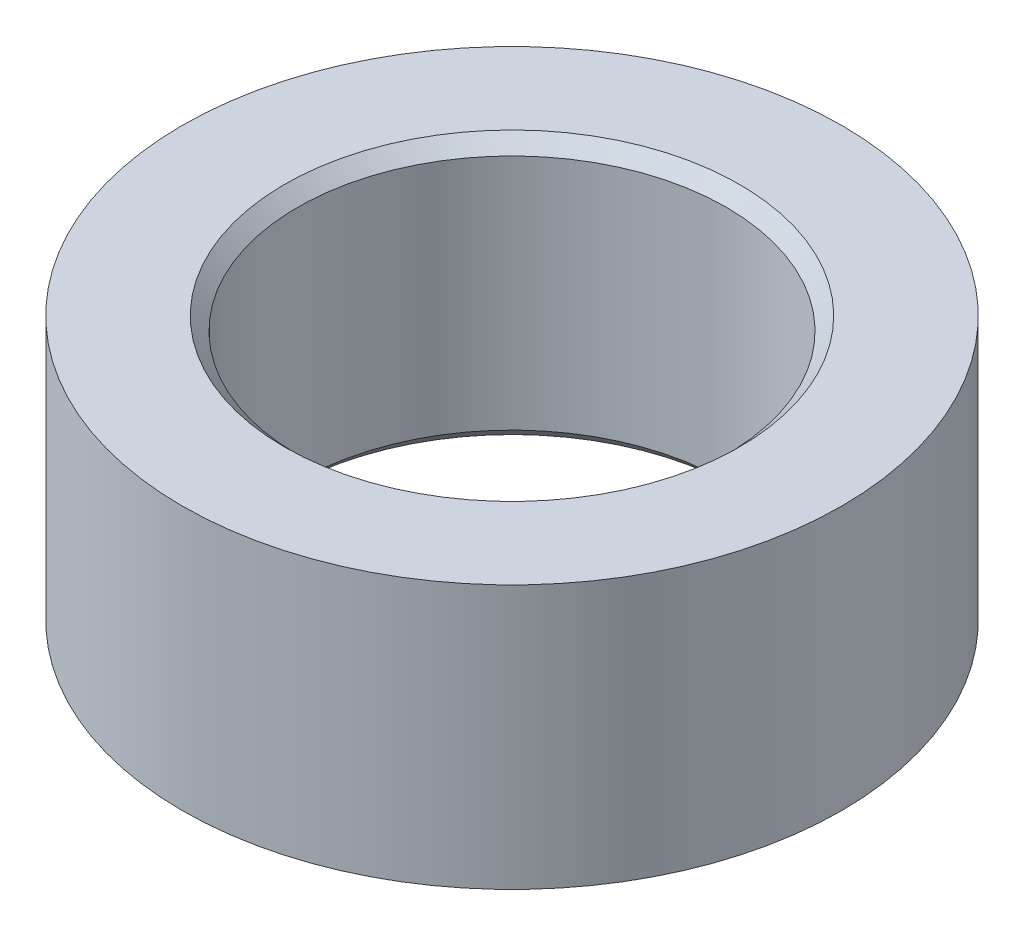
ISO-10303-21;
HEADER;
FILE_DESCRIPTION(('STEP AP214'),'2;1');
FILE_NAME('part.step','',(''),(''),'','','');
FILE_SCHEMA(('AUTOMOTIVE_DESIGN { 1 0 10303 214 1 1 1 1 }'));
ENDSEC;
DATA;
#1=APPLICATION_CONTEXT('core data for automotive mechanical design processes');
#2=APPLICATION_PROTOCOL_DEFINITION('international standard','automotive_design',2000,#1);
#3=PRODUCT_CONTEXT('',#1,'mechanical');
#4=PRODUCT('Part','Part','',(#3));
#5=PRODUCT_RELATED_PRODUCT_CATEGORY('part','',(#4));
#6=PRODUCT_DEFINITION_FORMATION('','',#4);
#7=PRODUCT_DEFINITION_CONTEXT('part definition',#1,'design');
#8=PRODUCT_DEFINITION('design','',#6,#7);
#9=PRODUCT_DEFINITION_SHAPE('','',#8);
#10=(LENGTH_UNIT() NAMED_UNIT(*) SI_UNIT(.MILLI.,.METRE.));
#11=(NAMED_UNIT(*) PLANE_ANGLE_UNIT() SI_UNIT($,.RADIAN.));
#12=(NAMED_UNIT(*) SI_UNIT($,.STERADIAN.) SOLID_ANGLE_UNIT());
#13=UNCERTAINTY_MEASURE_WITH_UNIT(LENGTH_MEASURE(1.E-05),#10,'distance_accuracy_value','');
#14=(GEOMETRIC_REPRESENTATION_CONTEXT(3) GLOBAL_UNCERTAINTY_ASSIGNED_CONTEXT((#13)) GLOBAL_UNIT_ASSIGNED_CONTEXT((#10,
#11,#12)) REPRESENTATION_CONTEXT('',''));
#15=CARTESIAN_POINT('',(0.,0.,0.));
#16=DIRECTION('',(0.,0.,1.));
#17=DIRECTION('',(1.,0.,0.));
#18=AXIS2_PLACEMENT_3D('',#15,#16,#17);
#19=CARTESIAN_POINT('',(0.,5.08,0.));
#20=DIRECTION('',(0.,1.,0.));
#21=DIRECTION('',(0.,0.,1.));
#22=AXIS2_PLACEMENT_3D('',#19,#20,#21);
#23=PLANE('',#22);
#24=CARTESIAN_POINT('',(0.,5.08,0.));
#25=DIRECTION('',(0.,1.,0.));
#26=DIRECTION('',(0.,0.,1.));
#27=AXIS2_PLACEMENT_3D('',#24,#25,#26);
#28=CIRCLE('',#27,4.3815);
#29=CARTESIAN_POINT('',(0.,5.08,4.3815));
#30=VERTEX_POINT('',#29);
#31=EDGE_CURVE('E47',#30,#30,#28,.F.);
#32=ORIENTED_EDGE('',*,*,#31,.T.);
#33=EDGE_LOOP('',(#32));
#34=FACE_BOUND('',#33,.T.);
#35=CARTESIAN_POINT('',(0.,5.08,0.));
#36=DIRECTION('',(0.,1.,0.));
#37=DIRECTION('',(0.,0.,1.));
#38=AXIS2_PLACEMENT_3D('',#35,#36,#37);
#39=CIRCLE('',#38,6.35);
#40=CARTESIAN_POINT('',(0.,5.08,6.35));
#41=VERTEX_POINT('',#40);
#42=EDGE_CURVE('E60',#41,#41,#39,.T.);
#43=ORIENTED_EDGE('',*,*,#42,.T.);
#44=EDGE_LOOP('',(#43));
#45=FACE_BOUND('',#44,.T.);
#46=ADVANCED_FACE('F39',(#34,#45),#23,.T.);
#47=CARTESIAN_POINT('',(0.,0.,0.));
#48=DIRECTION('',(0.,1.,0.));
#49=DIRECTION('',(0.,0.,1.));
#50=AXIS2_PLACEMENT_3D('',#47,#48,#49);
#51=PLANE('',#50);
#52=CARTESIAN_POINT('',(0.,0.,0.));
#53=DIRECTION('',(0.,1.,0.));
#54=DIRECTION('',(0.,0.,1.));
#55=AXIS2_PLACEMENT_3D('',#52,#53,#54);
#56=CIRCLE('',#55,4.3815);
#57=CARTESIAN_POINT('',(0.,0.,4.3815));
#58=VERTEX_POINT('',#57);
#59=EDGE_CURVE('E10',#58,#58,#56,.T.);
#60=ORIENTED_EDGE('',*,*,#59,.T.);
#61=EDGE_LOOP('',(#60));
#62=FACE_BOUND('',#61,.T.);
#63=CARTESIAN_POINT('',(0.,0.,0.));
#64=DIRECTION('',(0.,1.,0.));
#65=DIRECTION('',(0.,0.,1.));
#66=AXIS2_PLACEMENT_3D('',#63,#64,#65);
#67=CIRCLE('',#66,6.35);
#68=CARTESIAN_POINT('',(0.,0.,6.35));
#69=VERTEX_POINT('',#68);
#70=EDGE_CURVE('E61',#69,#69,#67,.T.);
#71=ORIENTED_EDGE('',*,*,#70,.F.);
#72=EDGE_LOOP('',(#71));
#73=FACE_BOUND('',#72,.T.);
#74=ADVANCED_FACE('F72',(#62,#73),#51,.F.);
#75=CARTESIAN_POINT('',(0.,5.08,0.));
#76=DIRECTION('',(0.,-1.,0.));
#77=DIRECTION('',(0.,0.,-1.));
#78=AXIS2_PLACEMENT_3D('',#75,#76,#77);
#79=CYLINDRICAL_SURFACE('',#78,6.35);
#80=ORIENTED_EDGE('',*,*,#42,.F.);
#81=EDGE_LOOP('',(#80));
#82=FACE_BOUND('',#81,.T.);
#83=ORIENTED_EDGE('',*,*,#70,.T.);
#84=EDGE_LOOP('',(#83));
#85=FACE_BOUND('',#84,.T.);
#86=ADVANCED_FACE('F68',(#82,#85),#79,.T.);
#87=CARTESIAN_POINT('',(0.,5.08,0.));
#88=DIRECTION('',(0.,-1.,0.));
#89=DIRECTION('',(0.,0.,-1.));
#90=AXIS2_PLACEMENT_3D('',#87,#88,#89);
#91=CYLINDRICAL_SURFACE('',#90,4.1275);
#92=CARTESIAN_POINT('',(0.,4.82599999999999,0.));
#93=DIRECTION('',(0.,1.,0.));
#94=DIRECTION('',(0.,0.,1.));
#95=AXIS2_PLACEMENT_3D('',#92,#93,#94);
#96=CIRCLE('',#95,4.1275);
#97=CARTESIAN_POINT('',(0.,4.82599999999999,4.1275));
#98=VERTEX_POINT('',#97);
#99=EDGE_CURVE('E51',#98,#98,#96,.T.);
#100=ORIENTED_EDGE('',*,*,#99,.T.);
#101=EDGE_LOOP('',(#100));
#102=FACE_BOUND('',#101,.T.);
#103=CARTESIAN_POINT('',(0.,0.254000000000003,0.));
#104=DIRECTION('',(0.,1.,0.));
#105=DIRECTION('',(0.,0.,1.));
#106=AXIS2_PLACEMENT_3D('',#103,#104,#105);
#107=CIRCLE('',#106,4.1275);
#108=CARTESIAN_POINT('',(0.,0.254000000000003,4.1275));
#109=VERTEX_POINT('',#108);
#110=EDGE_CURVE('E55',#109,#109,#107,.F.);
#111=ORIENTED_EDGE('',*,*,#110,.T.);
#112=EDGE_LOOP('',(#111));
#113=FACE_BOUND('',#112,.T.);
#114=ADVANCED_FACE('F71',(#102,#113),#91,.F.);
#115=CARTESIAN_POINT('',(0.,4.82599999999999,0.));
#116=DIRECTION('',(0.,1.,0.));
#117=DIRECTION('',(0.,0.,1.));
#118=AXIS2_PLACEMENT_3D('',#115,#116,#117);
#119=CONICAL_SURFACE('',#118,4.1275,0.785398163397443);
#120=ORIENTED_EDGE('',*,*,#31,.F.);
#121=EDGE_LOOP('',(#120));
#122=FACE_BOUND('',#121,.T.);
#123=ORIENTED_EDGE('',*,*,#99,.F.);
#124=EDGE_LOOP('',(#123));
#125=FACE_BOUND('',#124,.T.);
#126=ADVANCED_FACE('F84',(#122,#125),#119,.F.);
#127=CARTESIAN_POINT('',(0.,0.,0.));
#128=DIRECTION('',(0.,-1.,0.));
#129=DIRECTION('',(0.,0.,-1.));
#130=AXIS2_PLACEMENT_3D('',#127,#128,#129);
#131=CONICAL_SURFACE('',#130,4.3815,0.785398163397447);
#132=ORIENTED_EDGE('',*,*,#110,.F.);
#133=EDGE_LOOP('',(#132));
#134=FACE_BOUND('',#133,.T.);
#135=ORIENTED_EDGE('',*,*,#59,.F.);
#136=EDGE_LOOP('',(#135));
#137=FACE_BOUND('',#136,.T.);
#138=ADVANCED_FACE('F42',(#134,#137),#131,.F.);
#139=CLOSED_SHELL('',(#46,#74,#86,#114,#126,#138));
#140=MANIFOLD_SOLID_BREP('B2',#139);
#141=ADVANCED_BREP_SHAPE_REPRESENTATION('',(#18,#140),#14);
#142=SHAPE_DEFINITION_REPRESENTATION(#9,#141);
ENDSEC;
END-ISO-10303-21;
